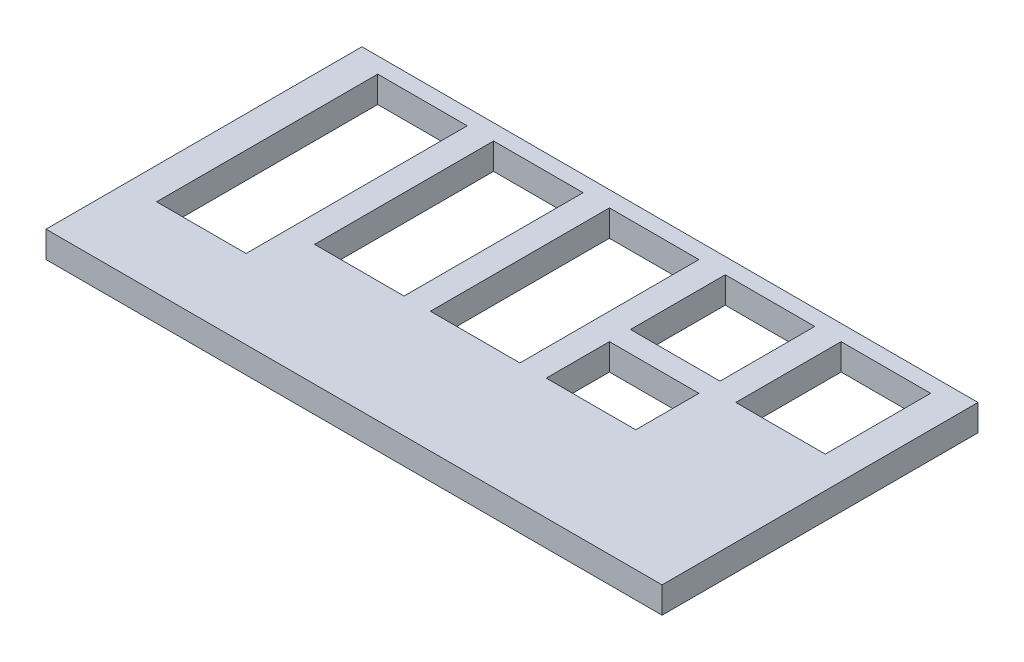
ISO-10303-21;
HEADER;
FILE_DESCRIPTION(('STEP AP214'),'2;1');
FILE_NAME('part.step','',(''),(''),'','','');
FILE_SCHEMA(('AUTOMOTIVE_DESIGN { 1 0 10303 214 1 1 1 1 }'));
ENDSEC;
DATA;
#1=APPLICATION_CONTEXT('core data for automotive mechanical design processes');
#2=APPLICATION_PROTOCOL_DEFINITION('international standard','automotive_design',2000,#1);
#3=PRODUCT_CONTEXT('',#1,'mechanical');
#4=PRODUCT('Part','Part','',(#3));
#5=PRODUCT_RELATED_PRODUCT_CATEGORY('part','',(#4));
#6=PRODUCT_DEFINITION_FORMATION('','',#4);
#7=PRODUCT_DEFINITION_CONTEXT('part definition',#1,'design');
#8=PRODUCT_DEFINITION('design','',#6,#7);
#9=PRODUCT_DEFINITION_SHAPE('','',#8);
#10=(LENGTH_UNIT() NAMED_UNIT(*) SI_UNIT(.MILLI.,.METRE.));
#11=(NAMED_UNIT(*) PLANE_ANGLE_UNIT() SI_UNIT($,.RADIAN.));
#12=(NAMED_UNIT(*) SI_UNIT($,.STERADIAN.) SOLID_ANGLE_UNIT());
#13=UNCERTAINTY_MEASURE_WITH_UNIT(LENGTH_MEASURE(1.E-05),#10,'distance_accuracy_value','');
#14=(GEOMETRIC_REPRESENTATION_CONTEXT(3) GLOBAL_UNCERTAINTY_ASSIGNED_CONTEXT((#13)) GLOBAL_UNIT_ASSIGNED_CONTEXT((#10,
#11,#12)) REPRESENTATION_CONTEXT('',''));
#15=CARTESIAN_POINT('',(0.,0.,0.));
#16=DIRECTION('',(0.,0.,1.));
#17=DIRECTION('',(1.,0.,0.));
#18=AXIS2_PLACEMENT_3D('',#15,#16,#17);
#19=CARTESIAN_POINT('',(0.,5.,-5.));
#20=DIRECTION('',(0.,0.,-1.));
#21=DIRECTION('',(-1.,0.,0.));
#22=AXIS2_PLACEMENT_3D('',#19,#20,#21);
#23=PLANE('',#22);
#24=DIRECTION('',(1.,0.,0.));
#25=VECTOR('',#24,1.);
#26=CARTESIAN_POINT('',(0.,0.,-5.));
#27=LINE('',#26,#25);
#28=CARTESIAN_POINT('',(13.5,0.,-5.));
#29=VERTEX_POINT('',#28);
#30=CARTESIAN_POINT('',(30.5,0.,-5.));
#31=VERTEX_POINT('',#30);
#32=EDGE_CURVE('E322',#29,#31,#27,.T.);
#33=ORIENTED_EDGE('',*,*,#32,.T.);
#34=DIRECTION('',(0.,-1.,0.));
#35=VECTOR('',#34,1.);
#36=CARTESIAN_POINT('',(30.5,5.,-5.));
#37=LINE('',#36,#35);
#38=CARTESIAN_POINT('',(30.5,5.,-5.));
#39=VERTEX_POINT('',#38);
#40=EDGE_CURVE('E11',#39,#31,#37,.T.);
#41=ORIENTED_EDGE('',*,*,#40,.F.);
#42=DIRECTION('',(1.,0.,0.));
#43=VECTOR('',#42,1.);
#44=CARTESIAN_POINT('',(0.,5.,-5.));
#45=LINE('',#44,#43);
#46=CARTESIAN_POINT('',(13.5,5.,-5.));
#47=VERTEX_POINT('',#46);
#48=EDGE_CURVE('E234',#47,#39,#45,.T.);
#49=ORIENTED_EDGE('',*,*,#48,.F.);
#50=DIRECTION('',(0.,-1.,0.));
#51=VECTOR('',#50,1.);
#52=CARTESIAN_POINT('',(13.5,5.,-5.));
#53=LINE('',#52,#51);
#54=EDGE_CURVE('E54',#47,#29,#53,.T.);
#55=ORIENTED_EDGE('',*,*,#54,.T.);
#56=EDGE_LOOP('',(#33,#41,#49,#55));
#57=FACE_BOUND('',#56,.T.);
#58=ADVANCED_FACE('F35',(#57),#23,.F.);
#59=CARTESIAN_POINT('',(30.5,5.,0.));
#60=DIRECTION('',(1.,0.,0.));
#61=DIRECTION('',(0.,0.,-1.));
#62=AXIS2_PLACEMENT_3D('',#59,#60,#61);
#63=PLANE('',#62);
#64=DIRECTION('',(0.,0.,1.));
#65=VECTOR('',#64,1.);
#66=CARTESIAN_POINT('',(30.5,0.,0.));
#67=LINE('',#66,#65);
#68=CARTESIAN_POINT('',(30.5,0.,7.));
#69=VERTEX_POINT('',#68);
#70=EDGE_CURVE('E240',#31,#69,#67,.T.);
#71=ORIENTED_EDGE('',*,*,#70,.T.);
#72=DIRECTION('',(0.,-1.,0.));
#73=VECTOR('',#72,1.);
#74=CARTESIAN_POINT('',(30.5,5.,7.));
#75=LINE('',#74,#73);
#76=CARTESIAN_POINT('',(30.5,5.,7.));
#77=VERTEX_POINT('',#76);
#78=EDGE_CURVE('E45',#77,#69,#75,.T.);
#79=ORIENTED_EDGE('',*,*,#78,.F.);
#80=DIRECTION('',(0.,0.,1.));
#81=VECTOR('',#80,1.);
#82=CARTESIAN_POINT('',(30.5,5.,0.));
#83=LINE('',#82,#81);
#84=EDGE_CURVE('E228',#39,#77,#83,.T.);
#85=ORIENTED_EDGE('',*,*,#84,.F.);
#86=ORIENTED_EDGE('',*,*,#40,.T.);
#87=EDGE_LOOP('',(#71,#79,#85,#86));
#88=FACE_BOUND('',#87,.T.);
#89=ADVANCED_FACE('F239',(#88),#63,.F.);
#90=CARTESIAN_POINT('',(0.,5.,7.));
#91=DIRECTION('',(0.,0.,-1.));
#92=DIRECTION('',(-1.,0.,0.));
#93=AXIS2_PLACEMENT_3D('',#90,#91,#92);
#94=PLANE('',#93);
#95=DIRECTION('',(1.,0.,0.));
#96=VECTOR('',#95,1.);
#97=CARTESIAN_POINT('',(0.,0.,7.));
#98=LINE('',#97,#96);
#99=CARTESIAN_POINT('',(13.5,0.,7.));
#100=VERTEX_POINT('',#99);
#101=EDGE_CURVE('E325',#100,#69,#98,.T.);
#102=ORIENTED_EDGE('',*,*,#101,.F.);
#103=DIRECTION('',(0.,-1.,0.));
#104=VECTOR('',#103,1.);
#105=CARTESIAN_POINT('',(13.5,5.,7.));
#106=LINE('',#105,#104);
#107=CARTESIAN_POINT('',(13.5,5.,7.));
#108=VERTEX_POINT('',#107);
#109=EDGE_CURVE('E140',#108,#100,#106,.T.);
#110=ORIENTED_EDGE('',*,*,#109,.F.);
#111=DIRECTION('',(1.,0.,0.));
#112=VECTOR('',#111,1.);
#113=CARTESIAN_POINT('',(0.,5.,7.));
#114=LINE('',#113,#112);
#115=EDGE_CURVE('E233',#108,#77,#114,.T.);
#116=ORIENTED_EDGE('',*,*,#115,.T.);
#117=ORIENTED_EDGE('',*,*,#78,.T.);
#118=EDGE_LOOP('',(#102,#110,#116,#117));
#119=FACE_BOUND('',#118,.T.);
#120=ADVANCED_FACE('F244',(#119),#94,.T.);
#121=CARTESIAN_POINT('',(0.,5.,30.));
#122=DIRECTION('',(0.,0.,-1.));
#123=DIRECTION('',(-1.,0.,0.));
#124=AXIS2_PLACEMENT_3D('',#121,#122,#123);
#125=PLANE('',#124);
#126=DIRECTION('',(1.,0.,0.));
#127=VECTOR('',#126,1.);
#128=CARTESIAN_POINT('',(0.,0.,30.));
#129=LINE('',#128,#127);
#130=CARTESIAN_POINT('',(-58.5,0.,30.));
#131=VERTEX_POINT('',#130);
#132=CARTESIAN_POINT('',(58.5,0.,30.));
#133=VERTEX_POINT('',#132);
#134=EDGE_CURVE('E310',#131,#133,#129,.T.);
#135=ORIENTED_EDGE('',*,*,#134,.T.);
#136=DIRECTION('',(0.,-1.,0.));
#137=VECTOR('',#136,1.);
#138=CARTESIAN_POINT('',(58.5,5.,30.));
#139=LINE('',#138,#137);
#140=CARTESIAN_POINT('',(58.5,5.,30.));
#141=VERTEX_POINT('',#140);
#142=EDGE_CURVE('E332',#141,#133,#139,.T.);
#143=ORIENTED_EDGE('',*,*,#142,.F.);
#144=DIRECTION('',(1.,0.,0.));
#145=VECTOR('',#144,1.);
#146=CARTESIAN_POINT('',(0.,5.,30.));
#147=LINE('',#146,#145);
#148=CARTESIAN_POINT('',(-58.5,5.,30.));
#149=VERTEX_POINT('',#148);
#150=EDGE_CURVE('E452',#149,#141,#147,.T.);
#151=ORIENTED_EDGE('',*,*,#150,.F.);
#152=DIRECTION('',(0.,-1.,0.));
#153=VECTOR('',#152,1.);
#154=CARTESIAN_POINT('',(-58.5,5.,30.));
#155=LINE('',#154,#153);
#156=EDGE_CURVE('E334',#149,#131,#155,.T.);
#157=ORIENTED_EDGE('',*,*,#156,.T.);
#158=EDGE_LOOP('',(#135,#143,#151,#157));
#159=FACE_BOUND('',#158,.T.);
#160=ADVANCED_FACE('F478',(#159),#125,.F.);
#161=CARTESIAN_POINT('',(58.5,5.,0.));
#162=DIRECTION('',(-1.,0.,0.));
#163=DIRECTION('',(0.,0.,1.));
#164=AXIS2_PLACEMENT_3D('',#161,#162,#163);
#165=PLANE('',#164);
#166=DIRECTION('',(0.,0.,-1.));
#167=VECTOR('',#166,1.);
#168=CARTESIAN_POINT('',(58.5,0.,0.));
#169=LINE('',#168,#167);
#170=CARTESIAN_POINT('',(58.5,0.,-30.));
#171=VERTEX_POINT('',#170);
#172=EDGE_CURVE('E313',#133,#171,#169,.T.);
#173=ORIENTED_EDGE('',*,*,#172,.T.);
#174=DIRECTION('',(0.,-1.,0.));
#175=VECTOR('',#174,1.);
#176=CARTESIAN_POINT('',(58.5,5.,-30.));
#177=LINE('',#176,#175);
#178=CARTESIAN_POINT('',(58.5,5.,-30.));
#179=VERTEX_POINT('',#178);
#180=EDGE_CURVE('E339',#179,#171,#177,.T.);
#181=ORIENTED_EDGE('',*,*,#180,.F.);
#182=DIRECTION('',(0.,0.,-1.));
#183=VECTOR('',#182,1.);
#184=CARTESIAN_POINT('',(58.5,5.,0.));
#185=LINE('',#184,#183);
#186=EDGE_CURVE('E455',#141,#179,#185,.T.);
#187=ORIENTED_EDGE('',*,*,#186,.F.);
#188=ORIENTED_EDGE('',*,*,#142,.T.);
#189=EDGE_LOOP('',(#173,#181,#187,#188));
#190=FACE_BOUND('',#189,.T.);
#191=ADVANCED_FACE('F480',(#190),#165,.F.);
#192=CARTESIAN_POINT('',(0.,5.,-30.));
#193=DIRECTION('',(0.,0.,-1.));
#194=DIRECTION('',(-1.,0.,0.));
#195=AXIS2_PLACEMENT_3D('',#192,#193,#194);
#196=PLANE('',#195);
#197=DIRECTION('',(1.,0.,0.));
#198=VECTOR('',#197,1.);
#199=CARTESIAN_POINT('',(0.,0.,-30.));
#200=LINE('',#199,#198);
#201=CARTESIAN_POINT('',(-58.5,0.,-30.));
#202=VERTEX_POINT('',#201);
#203=EDGE_CURVE('E316',#202,#171,#200,.T.);
#204=ORIENTED_EDGE('',*,*,#203,.F.);
#205=DIRECTION('',(0.,-1.,0.));
#206=VECTOR('',#205,1.);
#207=CARTESIAN_POINT('',(-58.5,5.,-30.));
#208=LINE('',#207,#206);
#209=CARTESIAN_POINT('',(-58.5,5.,-30.));
#210=VERTEX_POINT('',#209);
#211=EDGE_CURVE('E336',#210,#202,#208,.T.);
#212=ORIENTED_EDGE('',*,*,#211,.F.);
#213=DIRECTION('',(1.,0.,0.));
#214=VECTOR('',#213,1.);
#215=CARTESIAN_POINT('',(0.,5.,-30.));
#216=LINE('',#215,#214);
#217=EDGE_CURVE('E457',#210,#179,#216,.T.);
#218=ORIENTED_EDGE('',*,*,#217,.T.);
#219=ORIENTED_EDGE('',*,*,#180,.T.);
#220=EDGE_LOOP('',(#204,#212,#218,#219));
#221=FACE_BOUND('',#220,.T.);
#222=ADVANCED_FACE('F473',(#221),#196,.T.);
#223=CARTESIAN_POINT('',(-35.5,5.,0.));
#224=DIRECTION('',(-1.,0.,0.));
#225=DIRECTION('',(0.,0.,1.));
#226=AXIS2_PLACEMENT_3D('',#223,#224,#225);
#227=PLANE('',#226);
#228=DIRECTION('',(0.,0.,-1.));
#229=VECTOR('',#228,1.);
#230=CARTESIAN_POINT('',(-35.5,0.,0.));
#231=LINE('',#230,#229);
#232=CARTESIAN_POINT('',(-35.5,0.,15.));
#233=VERTEX_POINT('',#232);
#234=CARTESIAN_POINT('',(-35.5,0.,-27.));
#235=VERTEX_POINT('',#234);
#236=EDGE_CURVE('E298',#233,#235,#231,.T.);
#237=ORIENTED_EDGE('',*,*,#236,.F.);
#238=DIRECTION('',(0.,-1.,0.));
#239=VECTOR('',#238,1.);
#240=CARTESIAN_POINT('',(-35.5,5.,15.));
#241=LINE('',#240,#239);
#242=CARTESIAN_POINT('',(-35.5,5.,15.));
#243=VERTEX_POINT('',#242);
#244=EDGE_CURVE('E337',#243,#233,#241,.T.);
#245=ORIENTED_EDGE('',*,*,#244,.F.);
#246=DIRECTION('',(0.,0.,-1.));
#247=VECTOR('',#246,1.);
#248=CARTESIAN_POINT('',(-35.5,5.,0.));
#249=LINE('',#248,#247);
#250=CARTESIAN_POINT('',(-35.5,5.,-27.));
#251=VERTEX_POINT('',#250);
#252=EDGE_CURVE('E441',#243,#251,#249,.T.);
#253=ORIENTED_EDGE('',*,*,#252,.T.);
#254=DIRECTION('',(0.,-1.,0.));
#255=VECTOR('',#254,1.);
#256=CARTESIAN_POINT('',(-35.5,5.,-27.));
#257=LINE('',#256,#255);
#258=EDGE_CURVE('E343',#251,#235,#257,.T.);
#259=ORIENTED_EDGE('',*,*,#258,.T.);
#260=EDGE_LOOP('',(#237,#245,#253,#259));
#261=FACE_BOUND('',#260,.T.);
#262=ADVANCED_FACE('F487',(#261),#227,.T.);
#263=CARTESIAN_POINT('',(0.,5.,15.));
#264=DIRECTION('',(0.,0.,-1.));
#265=DIRECTION('',(-1.,0.,0.));
#266=AXIS2_PLACEMENT_3D('',#263,#264,#265);
#267=PLANE('',#266);
#268=DIRECTION('',(1.,0.,0.));
#269=VECTOR('',#268,1.);
#270=CARTESIAN_POINT('',(0.,0.,15.));
#271=LINE('',#270,#269);
#272=CARTESIAN_POINT('',(-52.5,0.,15.));
#273=VERTEX_POINT('',#272);
#274=EDGE_CURVE('E301',#273,#233,#271,.T.);
#275=ORIENTED_EDGE('',*,*,#274,.F.);
#276=DIRECTION('',(0.,-1.,0.));
#277=VECTOR('',#276,1.);
#278=CARTESIAN_POINT('',(-52.5,5.,15.));
#279=LINE('',#278,#277);
#280=CARTESIAN_POINT('',(-52.5,5.,15.));
#281=VERTEX_POINT('',#280);
#282=EDGE_CURVE('E349',#281,#273,#279,.T.);
#283=ORIENTED_EDGE('',*,*,#282,.F.);
#284=DIRECTION('',(1.,0.,0.));
#285=VECTOR('',#284,1.);
#286=CARTESIAN_POINT('',(0.,5.,15.));
#287=LINE('',#286,#285);
#288=EDGE_CURVE('E444',#281,#243,#287,.T.);
#289=ORIENTED_EDGE('',*,*,#288,.T.);
#290=ORIENTED_EDGE('',*,*,#244,.T.);
#291=EDGE_LOOP('',(#275,#283,#289,#290));
#292=FACE_BOUND('',#291,.T.);
#293=ADVANCED_FACE('F565',(#292),#267,.T.);
#294=CARTESIAN_POINT('',(-52.5,5.,0.));
#295=DIRECTION('',(-1.,0.,0.));
#296=DIRECTION('',(0.,0.,1.));
#297=AXIS2_PLACEMENT_3D('',#294,#295,#296);
#298=PLANE('',#297);
#299=DIRECTION('',(0.,0.,-1.));
#300=VECTOR('',#299,1.);
#301=CARTESIAN_POINT('',(-52.5,0.,0.));
#302=LINE('',#301,#300);
#303=CARTESIAN_POINT('',(-52.5,0.,-27.));
#304=VERTEX_POINT('',#303);
#305=EDGE_CURVE('E304',#273,#304,#302,.T.);
#306=ORIENTED_EDGE('',*,*,#305,.T.);
#307=DIRECTION('',(0.,-1.,0.));
#308=VECTOR('',#307,1.);
#309=CARTESIAN_POINT('',(-52.5,5.,-27.));
#310=LINE('',#309,#308);
#311=CARTESIAN_POINT('',(-52.5,5.,-27.));
#312=VERTEX_POINT('',#311);
#313=EDGE_CURVE('E345',#312,#304,#310,.T.);
#314=ORIENTED_EDGE('',*,*,#313,.F.);
#315=DIRECTION('',(0.,0.,-1.));
#316=VECTOR('',#315,1.);
#317=CARTESIAN_POINT('',(-52.5,5.,0.));
#318=LINE('',#317,#316);
#319=EDGE_CURVE('E447',#281,#312,#318,.T.);
#320=ORIENTED_EDGE('',*,*,#319,.F.);
#321=ORIENTED_EDGE('',*,*,#282,.T.);
#322=EDGE_LOOP('',(#306,#314,#320,#321));
#323=FACE_BOUND('',#322,.T.);
#324=ADVANCED_FACE('F552',(#323),#298,.F.);
#325=CARTESIAN_POINT('',(-30.5,5.,0.));
#326=DIRECTION('',(1.,0.,0.));
#327=DIRECTION('',(0.,0.,-1.));
#328=AXIS2_PLACEMENT_3D('',#325,#326,#327);
#329=PLANE('',#328);
#330=DIRECTION('',(0.,0.,1.));
#331=VECTOR('',#330,1.);
#332=CARTESIAN_POINT('',(-30.5,0.,0.));
#333=LINE('',#332,#331);
#334=CARTESIAN_POINT('',(-30.5,0.,-27.));
#335=VERTEX_POINT('',#334);
#336=CARTESIAN_POINT('',(-30.5,0.,6.99999999999999));
#337=VERTEX_POINT('',#336);
#338=EDGE_CURVE('E286',#335,#337,#333,.T.);
#339=ORIENTED_EDGE('',*,*,#338,.F.);
#340=DIRECTION('',(0.,-1.,0.));
#341=VECTOR('',#340,1.);
#342=CARTESIAN_POINT('',(-30.5,5.,-27.));
#343=LINE('',#342,#341);
#344=CARTESIAN_POINT('',(-30.5,5.,-27.));
#345=VERTEX_POINT('',#344);
#346=EDGE_CURVE('E346',#345,#335,#343,.T.);
#347=ORIENTED_EDGE('',*,*,#346,.F.);
#348=DIRECTION('',(0.,0.,1.));
#349=VECTOR('',#348,1.);
#350=CARTESIAN_POINT('',(-30.5,5.,0.));
#351=LINE('',#350,#349);
#352=CARTESIAN_POINT('',(-30.5,5.,6.99999999999999));
#353=VERTEX_POINT('',#352);
#354=EDGE_CURVE('E430',#345,#353,#351,.T.);
#355=ORIENTED_EDGE('',*,*,#354,.T.);
#356=DIRECTION('',(0.,-1.,0.));
#357=VECTOR('',#356,1.);
#358=CARTESIAN_POINT('',(-30.5,5.,6.99999999999999));
#359=LINE('',#358,#357);
#360=EDGE_CURVE('E352',#353,#337,#359,.T.);
#361=ORIENTED_EDGE('',*,*,#360,.T.);
#362=EDGE_LOOP('',(#339,#347,#355,#361));
#363=FACE_BOUND('',#362,.T.);
#364=ADVANCED_FACE('F548',(#363),#329,.T.);
#365=CARTESIAN_POINT('',(0.,5.,-27.));
#366=DIRECTION('',(0.,0.,1.));
#367=DIRECTION('',(1.,0.,0.));
#368=AXIS2_PLACEMENT_3D('',#365,#366,#367);
#369=PLANE('',#368);
#370=DIRECTION('',(-1.,0.,0.));
#371=VECTOR('',#370,1.);
#372=CARTESIAN_POINT('',(0.,0.,-27.));
#373=LINE('',#372,#371);
#374=CARTESIAN_POINT('',(-13.5,0.,-27.));
#375=VERTEX_POINT('',#374);
#376=EDGE_CURVE('E289',#375,#335,#373,.T.);
#377=ORIENTED_EDGE('',*,*,#376,.F.);
#378=DIRECTION('',(0.,-1.,0.));
#379=VECTOR('',#378,1.);
#380=CARTESIAN_POINT('',(-13.5,5.,-27.));
#381=LINE('',#380,#379);
#382=CARTESIAN_POINT('',(-13.5,5.,-27.));
#383=VERTEX_POINT('',#382);
#384=EDGE_CURVE('E358',#383,#375,#381,.T.);
#385=ORIENTED_EDGE('',*,*,#384,.F.);
#386=DIRECTION('',(-1.,0.,0.));
#387=VECTOR('',#386,1.);
#388=CARTESIAN_POINT('',(0.,5.,-27.));
#389=LINE('',#388,#387);
#390=EDGE_CURVE('E433',#383,#345,#389,.T.);
#391=ORIENTED_EDGE('',*,*,#390,.T.);
#392=ORIENTED_EDGE('',*,*,#346,.T.);
#393=EDGE_LOOP('',(#377,#385,#391,#392));
#394=FACE_BOUND('',#393,.T.);
#395=ADVANCED_FACE('F551',(#394),#369,.T.);
#396=CARTESIAN_POINT('',(-13.5,5.,0.));
#397=DIRECTION('',(1.,0.,0.));
#398=DIRECTION('',(0.,0.,-1.));
#399=AXIS2_PLACEMENT_3D('',#396,#397,#398);
#400=PLANE('',#399);
#401=DIRECTION('',(0.,0.,1.));
#402=VECTOR('',#401,1.);
#403=CARTESIAN_POINT('',(-13.5,0.,0.));
#404=LINE('',#403,#402);
#405=CARTESIAN_POINT('',(-13.5,0.,6.99999999999999));
#406=VERTEX_POINT('',#405);
#407=EDGE_CURVE('E292',#375,#406,#404,.T.);
#408=ORIENTED_EDGE('',*,*,#407,.T.);
#409=DIRECTION('',(0.,-1.,0.));
#410=VECTOR('',#409,1.);
#411=CARTESIAN_POINT('',(-13.5,5.,6.99999999999999));
#412=LINE('',#411,#410);
#413=CARTESIAN_POINT('',(-13.5,5.,6.99999999999999));
#414=VERTEX_POINT('',#413);
#415=EDGE_CURVE('E354',#414,#406,#412,.T.);
#416=ORIENTED_EDGE('',*,*,#415,.F.);
#417=DIRECTION('',(0.,0.,1.));
#418=VECTOR('',#417,1.);
#419=CARTESIAN_POINT('',(-13.5,5.,0.));
#420=LINE('',#419,#418);
#421=EDGE_CURVE('E436',#383,#414,#420,.T.);
#422=ORIENTED_EDGE('',*,*,#421,.F.);
#423=ORIENTED_EDGE('',*,*,#384,.T.);
#424=EDGE_LOOP('',(#408,#416,#422,#423));
#425=FACE_BOUND('',#424,.T.);
#426=ADVANCED_FACE('F537',(#425),#400,.F.);
#427=CARTESIAN_POINT('',(30.5,5.,0.));
#428=DIRECTION('',(-1.,0.,0.));
#429=DIRECTION('',(0.,0.,1.));
#430=AXIS2_PLACEMENT_3D('',#427,#428,#429);
#431=PLANE('',#430);
#432=DIRECTION('',(0.,0.,-1.));
#433=VECTOR('',#432,1.);
#434=CARTESIAN_POINT('',(30.5,0.,0.));
#435=LINE('',#434,#433);
#436=CARTESIAN_POINT('',(30.5,0.,-9.));
#437=VERTEX_POINT('',#436);
#438=CARTESIAN_POINT('',(30.5,0.,-27.));
#439=VERTEX_POINT('',#438);
#440=EDGE_CURVE('E274',#437,#439,#435,.T.);
#441=ORIENTED_EDGE('',*,*,#440,.F.);
#442=DIRECTION('',(0.,-1.,0.));
#443=VECTOR('',#442,1.);
#444=CARTESIAN_POINT('',(30.5,5.,-9.));
#445=LINE('',#444,#443);
#446=CARTESIAN_POINT('',(30.5,5.,-9.));
#447=VERTEX_POINT('',#446);
#448=EDGE_CURVE('E355',#447,#437,#445,.T.);
#449=ORIENTED_EDGE('',*,*,#448,.F.);
#450=DIRECTION('',(0.,0.,-1.));
#451=VECTOR('',#450,1.);
#452=CARTESIAN_POINT('',(30.5,5.,0.));
#453=LINE('',#452,#451);
#454=CARTESIAN_POINT('',(30.5,5.,-27.));
#455=VERTEX_POINT('',#454);
#456=EDGE_CURVE('E419',#447,#455,#453,.T.);
#457=ORIENTED_EDGE('',*,*,#456,.T.);
#458=DIRECTION('',(0.,-1.,0.));
#459=VECTOR('',#458,1.);
#460=CARTESIAN_POINT('',(30.5,5.,-27.));
#461=LINE('',#460,#459);
#462=EDGE_CURVE('E361',#455,#439,#461,.T.);
#463=ORIENTED_EDGE('',*,*,#462,.T.);
#464=EDGE_LOOP('',(#441,#449,#457,#463));
#465=FACE_BOUND('',#464,.T.);
#466=ADVANCED_FACE('F533',(#465),#431,.T.);
#467=CARTESIAN_POINT('',(0.,5.,-9.));
#468=DIRECTION('',(0.,0.,-1.));
#469=DIRECTION('',(-1.,0.,0.));
#470=AXIS2_PLACEMENT_3D('',#467,#468,#469);
#471=PLANE('',#470);
#472=DIRECTION('',(1.,0.,0.));
#473=VECTOR('',#472,1.);
#474=CARTESIAN_POINT('',(0.,0.,-9.));
#475=LINE('',#474,#473);
#476=CARTESIAN_POINT('',(13.5,0.,-9.));
#477=VERTEX_POINT('',#476);
#478=EDGE_CURVE('E277',#477,#437,#475,.T.);
#479=ORIENTED_EDGE('',*,*,#478,.F.);
#480=DIRECTION('',(0.,-1.,0.));
#481=VECTOR('',#480,1.);
#482=CARTESIAN_POINT('',(13.5,5.,-9.));
#483=LINE('',#482,#481);
#484=CARTESIAN_POINT('',(13.5,5.,-9.));
#485=VERTEX_POINT('',#484);
#486=EDGE_CURVE('E367',#485,#477,#483,.T.);
#487=ORIENTED_EDGE('',*,*,#486,.F.);
#488=DIRECTION('',(1.,0.,0.));
#489=VECTOR('',#488,1.);
#490=CARTESIAN_POINT('',(0.,5.,-9.));
#491=LINE('',#490,#489);
#492=EDGE_CURVE('E422',#485,#447,#491,.T.);
#493=ORIENTED_EDGE('',*,*,#492,.T.);
#494=ORIENTED_EDGE('',*,*,#448,.T.);
#495=EDGE_LOOP('',(#479,#487,#493,#494));
#496=FACE_BOUND('',#495,.T.);
#497=ADVANCED_FACE('F536',(#496),#471,.T.);
#498=CARTESIAN_POINT('',(13.5,5.,0.));
#499=DIRECTION('',(-1.,0.,0.));
#500=DIRECTION('',(0.,0.,1.));
#501=AXIS2_PLACEMENT_3D('',#498,#499,#500);
#502=PLANE('',#501);
#503=DIRECTION('',(0.,0.,-1.));
#504=VECTOR('',#503,1.);
#505=CARTESIAN_POINT('',(13.5,0.,0.));
#506=LINE('',#505,#504);
#507=CARTESIAN_POINT('',(13.5,0.,-27.));
#508=VERTEX_POINT('',#507);
#509=EDGE_CURVE('E280',#477,#508,#506,.T.);
#510=ORIENTED_EDGE('',*,*,#509,.T.);
#511=DIRECTION('',(0.,-1.,0.));
#512=VECTOR('',#511,1.);
#513=CARTESIAN_POINT('',(13.5,5.,-27.));
#514=LINE('',#513,#512);
#515=CARTESIAN_POINT('',(13.5,5.,-27.));
#516=VERTEX_POINT('',#515);
#517=EDGE_CURVE('E363',#516,#508,#514,.T.);
#518=ORIENTED_EDGE('',*,*,#517,.F.);
#519=DIRECTION('',(0.,0.,-1.));
#520=VECTOR('',#519,1.);
#521=CARTESIAN_POINT('',(13.5,5.,0.));
#522=LINE('',#521,#520);
#523=EDGE_CURVE('E425',#485,#516,#522,.T.);
#524=ORIENTED_EDGE('',*,*,#523,.F.);
#525=ORIENTED_EDGE('',*,*,#486,.T.);
#526=EDGE_LOOP('',(#510,#518,#524,#525));
#527=FACE_BOUND('',#526,.T.);
#528=ADVANCED_FACE('F520',(#527),#502,.F.);
#529=CARTESIAN_POINT('',(8.5,5.,0.));
#530=DIRECTION('',(-1.,0.,0.));
#531=DIRECTION('',(0.,0.,1.));
#532=AXIS2_PLACEMENT_3D('',#529,#530,#531);
#533=PLANE('',#532);
#534=DIRECTION('',(0.,0.,-1.));
#535=VECTOR('',#534,1.);
#536=CARTESIAN_POINT('',(8.5,0.,0.));
#537=LINE('',#536,#535);
#538=CARTESIAN_POINT('',(8.5,0.,7.));
#539=VERTEX_POINT('',#538);
#540=CARTESIAN_POINT('',(8.5,0.,-27.));
#541=VERTEX_POINT('',#540);
#542=EDGE_CURVE('E262',#539,#541,#537,.T.);
#543=ORIENTED_EDGE('',*,*,#542,.F.);
#544=DIRECTION('',(0.,-1.,0.));
#545=VECTOR('',#544,1.);
#546=CARTESIAN_POINT('',(8.5,5.,7.));
#547=LINE('',#546,#545);
#548=CARTESIAN_POINT('',(8.5,5.,7.));
#549=VERTEX_POINT('',#548);
#550=EDGE_CURVE('E364',#549,#539,#547,.T.);
#551=ORIENTED_EDGE('',*,*,#550,.F.);
#552=DIRECTION('',(0.,0.,-1.));
#553=VECTOR('',#552,1.);
#554=CARTESIAN_POINT('',(8.5,5.,0.));
#555=LINE('',#554,#553);
#556=CARTESIAN_POINT('',(8.5,5.,-27.));
#557=VERTEX_POINT('',#556);
#558=EDGE_CURVE('E403',#549,#557,#555,.T.);
#559=ORIENTED_EDGE('',*,*,#558,.T.);
#560=DIRECTION('',(0.,-1.,0.));
#561=VECTOR('',#560,1.);
#562=CARTESIAN_POINT('',(8.5,5.,-27.));
#563=LINE('',#562,#561);
#564=EDGE_CURVE('E370',#557,#541,#563,.T.);
#565=ORIENTED_EDGE('',*,*,#564,.T.);
#566=EDGE_LOOP('',(#543,#551,#559,#565));
#567=FACE_BOUND('',#566,.T.);
#568=ADVANCED_FACE('F516',(#567),#533,.T.);
#569=CARTESIAN_POINT('',(0.,5.,7.));
#570=DIRECTION('',(0.,0.,-1.));
#571=DIRECTION('',(-1.,0.,0.));
#572=AXIS2_PLACEMENT_3D('',#569,#570,#571);
#573=PLANE('',#572);
#574=DIRECTION('',(1.,0.,0.));
#575=VECTOR('',#574,1.);
#576=CARTESIAN_POINT('',(0.,0.,7.));
#577=LINE('',#576,#575);
#578=CARTESIAN_POINT('',(-8.5,0.,7.));
#579=VERTEX_POINT('',#578);
#580=EDGE_CURVE('E265',#579,#539,#577,.T.);
#581=ORIENTED_EDGE('',*,*,#580,.F.);
#582=DIRECTION('',(0.,-1.,0.));
#583=VECTOR('',#582,1.);
#584=CARTESIAN_POINT('',(-8.5,5.,7.));
#585=LINE('',#584,#583);
#586=CARTESIAN_POINT('',(-8.5,5.,7.));
#587=VERTEX_POINT('',#586);
#588=EDGE_CURVE('E375',#587,#579,#585,.T.);
#589=ORIENTED_EDGE('',*,*,#588,.F.);
#590=DIRECTION('',(1.,0.,0.));
#591=VECTOR('',#590,1.);
#592=CARTESIAN_POINT('',(0.,5.,7.));
#593=LINE('',#592,#591);
#594=EDGE_CURVE('E407',#587,#549,#593,.T.);
#595=ORIENTED_EDGE('',*,*,#594,.T.);
#596=ORIENTED_EDGE('',*,*,#550,.T.);
#597=EDGE_LOOP('',(#581,#589,#595,#596));
#598=FACE_BOUND('',#597,.T.);
#599=ADVANCED_FACE('F519',(#598),#573,.T.);
#600=CARTESIAN_POINT('',(-8.5,5.,0.));
#601=DIRECTION('',(-1.,0.,0.));
#602=DIRECTION('',(0.,0.,1.));
#603=AXIS2_PLACEMENT_3D('',#600,#601,#602);
#604=PLANE('',#603);
#605=DIRECTION('',(0.,0.,-1.));
#606=VECTOR('',#605,1.);
#607=CARTESIAN_POINT('',(-8.5,0.,0.));
#608=LINE('',#607,#606);
#609=CARTESIAN_POINT('',(-8.5,0.,-27.));
#610=VERTEX_POINT('',#609);
#611=EDGE_CURVE('E268',#579,#610,#608,.T.);
#612=ORIENTED_EDGE('',*,*,#611,.T.);
#613=DIRECTION('',(0.,-1.,0.));
#614=VECTOR('',#613,1.);
#615=CARTESIAN_POINT('',(-8.5,5.,-27.));
#616=LINE('',#615,#614);
#617=CARTESIAN_POINT('',(-8.5,5.,-27.));
#618=VERTEX_POINT('',#617);
#619=EDGE_CURVE('E372',#618,#610,#616,.T.);
#620=ORIENTED_EDGE('',*,*,#619,.F.);
#621=DIRECTION('',(0.,0.,-1.));
#622=VECTOR('',#621,1.);
#623=CARTESIAN_POINT('',(-8.5,5.,0.));
#624=LINE('',#623,#622);
#625=EDGE_CURVE('E414',#587,#618,#624,.T.);
#626=ORIENTED_EDGE('',*,*,#625,.F.);
#627=ORIENTED_EDGE('',*,*,#588,.T.);
#628=EDGE_LOOP('',(#612,#620,#626,#627));
#629=FACE_BOUND('',#628,.T.);
#630=ADVANCED_FACE('F524',(#629),#604,.F.);
#631=CARTESIAN_POINT('',(52.5,5.,0.));
#632=DIRECTION('',(-1.,0.,0.));
#633=DIRECTION('',(0.,0.,1.));
#634=AXIS2_PLACEMENT_3D('',#631,#632,#633);
#635=PLANE('',#634);
#636=DIRECTION('',(0.,0.,-1.));
#637=VECTOR('',#636,1.);
#638=CARTESIAN_POINT('',(52.5,0.,0.));
#639=LINE('',#638,#637);
#640=CARTESIAN_POINT('',(52.5,0.,-6.99999999999999));
#641=VERTEX_POINT('',#640);
#642=CARTESIAN_POINT('',(52.5,0.,-27.));
#643=VERTEX_POINT('',#642);
#644=EDGE_CURVE('E251',#641,#643,#639,.T.);
#645=ORIENTED_EDGE('',*,*,#644,.F.);
#646=DIRECTION('',(0.,-1.,0.));
#647=VECTOR('',#646,1.);
#648=CARTESIAN_POINT('',(52.5,5.,-6.99999999999999));
#649=LINE('',#648,#647);
#650=CARTESIAN_POINT('',(52.5,5.,-6.99999999999999));
#651=VERTEX_POINT('',#650);
#652=EDGE_CURVE('E39',#651,#641,#649,.T.);
#653=ORIENTED_EDGE('',*,*,#652,.F.);
#654=DIRECTION('',(0.,0.,-1.));
#655=VECTOR('',#654,1.);
#656=CARTESIAN_POINT('',(52.5,5.,0.));
#657=LINE('',#656,#655);
#658=CARTESIAN_POINT('',(52.5,5.,-27.));
#659=VERTEX_POINT('',#658);
#660=EDGE_CURVE('E330',#651,#659,#657,.T.);
#661=ORIENTED_EDGE('',*,*,#660,.T.);
#662=DIRECTION('',(0.,-1.,0.));
#663=VECTOR('',#662,1.);
#664=CARTESIAN_POINT('',(52.5,5.,-27.));
#665=LINE('',#664,#663);
#666=EDGE_CURVE('E247',#659,#643,#665,.T.);
#667=ORIENTED_EDGE('',*,*,#666,.T.);
#668=EDGE_LOOP('',(#645,#653,#661,#667));
#669=FACE_BOUND('',#668,.T.);
#670=ADVANCED_FACE('F37',(#669),#635,.T.);
#671=CARTESIAN_POINT('',(0.,5.,-6.99999999999999));
#672=DIRECTION('',(0.,0.,-1.));
#673=DIRECTION('',(-1.,0.,0.));
#674=AXIS2_PLACEMENT_3D('',#671,#672,#673);
#675=PLANE('',#674);
#676=DIRECTION('',(1.,0.,0.));
#677=VECTOR('',#676,1.);
#678=CARTESIAN_POINT('',(0.,0.,-6.99999999999999));
#679=LINE('',#678,#677);
#680=CARTESIAN_POINT('',(35.5,0.,-6.99999999999999));
#681=VERTEX_POINT('',#680);
#682=EDGE_CURVE('E254',#681,#641,#679,.T.);
#683=ORIENTED_EDGE('',*,*,#682,.F.);
#684=DIRECTION('',(0.,-1.,0.));
#685=VECTOR('',#684,1.);
#686=CARTESIAN_POINT('',(35.5,5.,-6.99999999999999));
#687=LINE('',#686,#685);
#688=CARTESIAN_POINT('',(35.5,5.,-6.99999999999999));
#689=VERTEX_POINT('',#688);
#690=EDGE_CURVE('E381',#689,#681,#687,.T.);
#691=ORIENTED_EDGE('',*,*,#690,.F.);
#692=DIRECTION('',(1.,0.,0.));
#693=VECTOR('',#692,1.);
#694=CARTESIAN_POINT('',(0.,5.,-6.99999999999999));
#695=LINE('',#694,#693);
#696=EDGE_CURVE('E390',#689,#651,#695,.T.);
#697=ORIENTED_EDGE('',*,*,#696,.T.);
#698=ORIENTED_EDGE('',*,*,#652,.T.);
#699=EDGE_LOOP('',(#683,#691,#697,#698));
#700=FACE_BOUND('',#699,.T.);
#701=ADVANCED_FACE('F388',(#700),#675,.T.);
#702=CARTESIAN_POINT('',(35.5,5.,0.));
#703=DIRECTION('',(-1.,0.,0.));
#704=DIRECTION('',(0.,0.,1.));
#705=AXIS2_PLACEMENT_3D('',#702,#703,#704);
#706=PLANE('',#705);
#707=DIRECTION('',(0.,0.,-1.));
#708=VECTOR('',#707,1.);
#709=CARTESIAN_POINT('',(35.5,0.,0.));
#710=LINE('',#709,#708);
#711=CARTESIAN_POINT('',(35.5,0.,-27.));
#712=VERTEX_POINT('',#711);
#713=EDGE_CURVE('E257',#681,#712,#710,.T.);
#714=ORIENTED_EDGE('',*,*,#713,.T.);
#715=DIRECTION('',(0.,-1.,0.));
#716=VECTOR('',#715,1.);
#717=CARTESIAN_POINT('',(35.5,5.,-27.));
#718=LINE('',#717,#716);
#719=CARTESIAN_POINT('',(35.5,5.,-27.));
#720=VERTEX_POINT('',#719);
#721=EDGE_CURVE('E379',#720,#712,#718,.T.);
#722=ORIENTED_EDGE('',*,*,#721,.F.);
#723=DIRECTION('',(0.,0.,-1.));
#724=VECTOR('',#723,1.);
#725=CARTESIAN_POINT('',(35.5,5.,0.));
#726=LINE('',#725,#724);
#727=EDGE_CURVE('E404',#689,#720,#726,.T.);
#728=ORIENTED_EDGE('',*,*,#727,.F.);
#729=ORIENTED_EDGE('',*,*,#690,.T.);
#730=EDGE_LOOP('',(#714,#722,#728,#729));
#731=FACE_BOUND('',#730,.T.);
#732=ADVANCED_FACE('F397',(#731),#706,.F.);
#733=CARTESIAN_POINT('',(-58.5,5.,0.));
#734=DIRECTION('',(-1.,0.,0.));
#735=DIRECTION('',(0.,0.,1.));
#736=AXIS2_PLACEMENT_3D('',#733,#734,#735);
#737=PLANE('',#736);
#738=DIRECTION('',(0.,0.,-1.));
#739=VECTOR('',#738,1.);
#740=CARTESIAN_POINT('',(-58.5,0.,0.));
#741=LINE('',#740,#739);
#742=EDGE_CURVE('E319',#131,#202,#741,.T.);
#743=ORIENTED_EDGE('',*,*,#742,.F.);
#744=ORIENTED_EDGE('',*,*,#156,.F.);
#745=DIRECTION('',(0.,0.,-1.));
#746=VECTOR('',#745,1.);
#747=CARTESIAN_POINT('',(-58.5,5.,0.));
#748=LINE('',#747,#746);
#749=EDGE_CURVE('E460',#149,#210,#748,.T.);
#750=ORIENTED_EDGE('',*,*,#749,.T.);
#751=ORIENTED_EDGE('',*,*,#211,.T.);
#752=EDGE_LOOP('',(#743,#744,#750,#751));
#753=FACE_BOUND('',#752,.T.);
#754=ADVANCED_FACE('F465',(#753),#737,.T.);
#755=CARTESIAN_POINT('',(0.,5.,-27.));
#756=DIRECTION('',(0.,0.,-1.));
#757=DIRECTION('',(-1.,0.,0.));
#758=AXIS2_PLACEMENT_3D('',#755,#756,#757);
#759=PLANE('',#758);
#760=DIRECTION('',(1.,0.,0.));
#761=VECTOR('',#760,1.);
#762=CARTESIAN_POINT('',(0.,0.,-27.));
#763=LINE('',#762,#761);
#764=EDGE_CURVE('E307',#304,#235,#763,.T.);
#765=ORIENTED_EDGE('',*,*,#764,.T.);
#766=ORIENTED_EDGE('',*,*,#258,.F.);
#767=DIRECTION('',(1.,0.,0.));
#768=VECTOR('',#767,1.);
#769=CARTESIAN_POINT('',(0.,5.,-27.));
#770=LINE('',#769,#768);
#771=EDGE_CURVE('E450',#312,#251,#770,.T.);
#772=ORIENTED_EDGE('',*,*,#771,.F.);
#773=ORIENTED_EDGE('',*,*,#313,.T.);
#774=EDGE_LOOP('',(#765,#766,#772,#773));
#775=FACE_BOUND('',#774,.T.);
#776=ADVANCED_FACE('F499',(#775),#759,.F.);
#777=CARTESIAN_POINT('',(0.,5.,6.99999999999999));
#778=DIRECTION('',(0.,0.,1.));
#779=DIRECTION('',(1.,0.,0.));
#780=AXIS2_PLACEMENT_3D('',#777,#778,#779);
#781=PLANE('',#780);
#782=DIRECTION('',(-1.,0.,0.));
#783=VECTOR('',#782,1.);
#784=CARTESIAN_POINT('',(0.,0.,6.99999999999999));
#785=LINE('',#784,#783);
#786=EDGE_CURVE('E295',#406,#337,#785,.T.);
#787=ORIENTED_EDGE('',*,*,#786,.T.);
#788=ORIENTED_EDGE('',*,*,#360,.F.);
#789=DIRECTION('',(-1.,0.,0.));
#790=VECTOR('',#789,1.);
#791=CARTESIAN_POINT('',(0.,5.,6.99999999999999));
#792=LINE('',#791,#790);
#793=EDGE_CURVE('E439',#414,#353,#792,.T.);
#794=ORIENTED_EDGE('',*,*,#793,.F.);
#795=ORIENTED_EDGE('',*,*,#415,.T.);
#796=EDGE_LOOP('',(#787,#788,#794,#795));
#797=FACE_BOUND('',#796,.T.);
#798=ADVANCED_FACE('F504',(#797),#781,.F.);
#799=CARTESIAN_POINT('',(0.,5.,-27.));
#800=DIRECTION('',(0.,0.,-1.));
#801=DIRECTION('',(-1.,0.,0.));
#802=AXIS2_PLACEMENT_3D('',#799,#800,#801);
#803=PLANE('',#802);
#804=DIRECTION('',(1.,0.,0.));
#805=VECTOR('',#804,1.);
#806=CARTESIAN_POINT('',(0.,0.,-27.));
#807=LINE('',#806,#805);
#808=EDGE_CURVE('E283',#508,#439,#807,.T.);
#809=ORIENTED_EDGE('',*,*,#808,.T.);
#810=ORIENTED_EDGE('',*,*,#462,.F.);
#811=DIRECTION('',(1.,0.,0.));
#812=VECTOR('',#811,1.);
#813=CARTESIAN_POINT('',(0.,5.,-27.));
#814=LINE('',#813,#812);
#815=EDGE_CURVE('E428',#516,#455,#814,.T.);
#816=ORIENTED_EDGE('',*,*,#815,.F.);
#817=ORIENTED_EDGE('',*,*,#517,.T.);
#818=EDGE_LOOP('',(#809,#810,#816,#817));
#819=FACE_BOUND('',#818,.T.);
#820=ADVANCED_FACE('F531',(#819),#803,.F.);
#821=CARTESIAN_POINT('',(0.,5.,-27.));
#822=DIRECTION('',(0.,0.,-1.));
#823=DIRECTION('',(-1.,0.,0.));
#824=AXIS2_PLACEMENT_3D('',#821,#822,#823);
#825=PLANE('',#824);
#826=DIRECTION('',(1.,0.,0.));
#827=VECTOR('',#826,1.);
#828=CARTESIAN_POINT('',(0.,0.,-27.));
#829=LINE('',#828,#827);
#830=EDGE_CURVE('E271',#610,#541,#829,.T.);
#831=ORIENTED_EDGE('',*,*,#830,.T.);
#832=ORIENTED_EDGE('',*,*,#564,.F.);
#833=DIRECTION('',(1.,0.,0.));
#834=VECTOR('',#833,1.);
#835=CARTESIAN_POINT('',(0.,5.,-27.));
#836=LINE('',#835,#834);
#837=EDGE_CURVE('E417',#618,#557,#836,.T.);
#838=ORIENTED_EDGE('',*,*,#837,.F.);
#839=ORIENTED_EDGE('',*,*,#619,.T.);
#840=EDGE_LOOP('',(#831,#832,#838,#839));
#841=FACE_BOUND('',#840,.T.);
#842=ADVANCED_FACE('F515',(#841),#825,.F.);
#843=CARTESIAN_POINT('',(0.,5.,-27.));
#844=DIRECTION('',(0.,0.,-1.));
#845=DIRECTION('',(-1.,0.,0.));
#846=AXIS2_PLACEMENT_3D('',#843,#844,#845);
#847=PLANE('',#846);
#848=DIRECTION('',(1.,0.,0.));
#849=VECTOR('',#848,1.);
#850=CARTESIAN_POINT('',(0.,0.,-27.));
#851=LINE('',#850,#849);
#852=EDGE_CURVE('E259',#712,#643,#851,.T.);
#853=ORIENTED_EDGE('',*,*,#852,.T.);
#854=ORIENTED_EDGE('',*,*,#666,.F.);
#855=DIRECTION('',(1.,0.,0.));
#856=VECTOR('',#855,1.);
#857=CARTESIAN_POINT('',(0.,5.,-27.));
#858=LINE('',#857,#856);
#859=EDGE_CURVE('E401',#720,#659,#858,.T.);
#860=ORIENTED_EDGE('',*,*,#859,.F.);
#861=ORIENTED_EDGE('',*,*,#721,.T.);
#862=EDGE_LOOP('',(#853,#854,#860,#861));
#863=FACE_BOUND('',#862,.T.);
#864=ADVANCED_FACE('F400',(#863),#847,.F.);
#865=CARTESIAN_POINT('',(13.5,5.,0.));
#866=DIRECTION('',(1.,0.,0.));
#867=DIRECTION('',(0.,0.,-1.));
#868=AXIS2_PLACEMENT_3D('',#865,#866,#867);
#869=PLANE('',#868);
#870=DIRECTION('',(0.,0.,1.));
#871=VECTOR('',#870,1.);
#872=CARTESIAN_POINT('',(13.5,0.,0.));
#873=LINE('',#872,#871);
#874=EDGE_CURVE('E327',#29,#100,#873,.T.);
#875=ORIENTED_EDGE('',*,*,#874,.F.);
#876=ORIENTED_EDGE('',*,*,#54,.F.);
#877=DIRECTION('',(0.,0.,1.));
#878=VECTOR('',#877,1.);
#879=CARTESIAN_POINT('',(13.5,5.,0.));
#880=LINE('',#879,#878);
#881=EDGE_CURVE('E245',#47,#108,#880,.T.);
#882=ORIENTED_EDGE('',*,*,#881,.T.);
#883=ORIENTED_EDGE('',*,*,#109,.T.);
#884=EDGE_LOOP('',(#875,#876,#882,#883));
#885=FACE_BOUND('',#884,.T.);
#886=ADVANCED_FACE('F514',(#885),#869,.T.);
#887=CARTESIAN_POINT('',(0.,5.,0.));
#888=DIRECTION('',(0.,1.,0.));
#889=DIRECTION('',(0.,0.,1.));
#890=AXIS2_PLACEMENT_3D('',#887,#888,#889);
#891=PLANE('',#890);
#892=ORIENTED_EDGE('',*,*,#660,.F.);
#893=ORIENTED_EDGE('',*,*,#696,.F.);
#894=ORIENTED_EDGE('',*,*,#727,.T.);
#895=ORIENTED_EDGE('',*,*,#859,.T.);
#896=EDGE_LOOP('',(#892,#893,#894,#895));
#897=FACE_BOUND('',#896,.T.);
#898=ORIENTED_EDGE('',*,*,#558,.F.);
#899=ORIENTED_EDGE('',*,*,#594,.F.);
#900=ORIENTED_EDGE('',*,*,#625,.T.);
#901=ORIENTED_EDGE('',*,*,#837,.T.);
#902=EDGE_LOOP('',(#898,#899,#900,#901));
#903=FACE_BOUND('',#902,.T.);
#904=ORIENTED_EDGE('',*,*,#456,.F.);
#905=ORIENTED_EDGE('',*,*,#492,.F.);
#906=ORIENTED_EDGE('',*,*,#523,.T.);
#907=ORIENTED_EDGE('',*,*,#815,.T.);
#908=EDGE_LOOP('',(#904,#905,#906,#907));
#909=FACE_BOUND('',#908,.T.);
#910=ORIENTED_EDGE('',*,*,#354,.F.);
#911=ORIENTED_EDGE('',*,*,#390,.F.);
#912=ORIENTED_EDGE('',*,*,#421,.T.);
#913=ORIENTED_EDGE('',*,*,#793,.T.);
#914=EDGE_LOOP('',(#910,#911,#912,#913));
#915=FACE_BOUND('',#914,.T.);
#916=ORIENTED_EDGE('',*,*,#252,.F.);
#917=ORIENTED_EDGE('',*,*,#288,.F.);
#918=ORIENTED_EDGE('',*,*,#319,.T.);
#919=ORIENTED_EDGE('',*,*,#771,.T.);
#920=EDGE_LOOP('',(#916,#917,#918,#919));
#921=FACE_BOUND('',#920,.T.);
#922=ORIENTED_EDGE('',*,*,#150,.T.);
#923=ORIENTED_EDGE('',*,*,#186,.T.);
#924=ORIENTED_EDGE('',*,*,#217,.F.);
#925=ORIENTED_EDGE('',*,*,#749,.F.);
#926=EDGE_LOOP('',(#922,#923,#924,#925));
#927=FACE_BOUND('',#926,.T.);
#928=ORIENTED_EDGE('',*,*,#48,.T.);
#929=ORIENTED_EDGE('',*,*,#84,.T.);
#930=ORIENTED_EDGE('',*,*,#115,.F.);
#931=ORIENTED_EDGE('',*,*,#881,.F.);
#932=EDGE_LOOP('',(#928,#929,#930,#931));
#933=FACE_BOUND('',#932,.T.);
#934=ADVANCED_FACE('F230',(#897,#903,#909,#915,#921,#927,#933),#891,.T.);
#935=CARTESIAN_POINT('',(0.,0.,0.));
#936=DIRECTION('',(0.,1.,0.));
#937=DIRECTION('',(0.,0.,1.));
#938=AXIS2_PLACEMENT_3D('',#935,#936,#937);
#939=PLANE('',#938);
#940=ORIENTED_EDGE('',*,*,#644,.T.);
#941=ORIENTED_EDGE('',*,*,#852,.F.);
#942=ORIENTED_EDGE('',*,*,#713,.F.);
#943=ORIENTED_EDGE('',*,*,#682,.T.);
#944=EDGE_LOOP('',(#940,#941,#942,#943));
#945=FACE_BOUND('',#944,.T.);
#946=ORIENTED_EDGE('',*,*,#542,.T.);
#947=ORIENTED_EDGE('',*,*,#830,.F.);
#948=ORIENTED_EDGE('',*,*,#611,.F.);
#949=ORIENTED_EDGE('',*,*,#580,.T.);
#950=EDGE_LOOP('',(#946,#947,#948,#949));
#951=FACE_BOUND('',#950,.T.);
#952=ORIENTED_EDGE('',*,*,#440,.T.);
#953=ORIENTED_EDGE('',*,*,#808,.F.);
#954=ORIENTED_EDGE('',*,*,#509,.F.);
#955=ORIENTED_EDGE('',*,*,#478,.T.);
#956=EDGE_LOOP('',(#952,#953,#954,#955));
#957=FACE_BOUND('',#956,.T.);
#958=ORIENTED_EDGE('',*,*,#338,.T.);
#959=ORIENTED_EDGE('',*,*,#786,.F.);
#960=ORIENTED_EDGE('',*,*,#407,.F.);
#961=ORIENTED_EDGE('',*,*,#376,.T.);
#962=EDGE_LOOP('',(#958,#959,#960,#961));
#963=FACE_BOUND('',#962,.T.);
#964=ORIENTED_EDGE('',*,*,#236,.T.);
#965=ORIENTED_EDGE('',*,*,#764,.F.);
#966=ORIENTED_EDGE('',*,*,#305,.F.);
#967=ORIENTED_EDGE('',*,*,#274,.T.);
#968=EDGE_LOOP('',(#964,#965,#966,#967));
#969=FACE_BOUND('',#968,.T.);
#970=ORIENTED_EDGE('',*,*,#134,.F.);
#971=ORIENTED_EDGE('',*,*,#742,.T.);
#972=ORIENTED_EDGE('',*,*,#203,.T.);
#973=ORIENTED_EDGE('',*,*,#172,.F.);
#974=EDGE_LOOP('',(#970,#971,#972,#973));
#975=FACE_BOUND('',#974,.T.);
#976=ORIENTED_EDGE('',*,*,#32,.F.);
#977=ORIENTED_EDGE('',*,*,#874,.T.);
#978=ORIENTED_EDGE('',*,*,#101,.T.);
#979=ORIENTED_EDGE('',*,*,#70,.F.);
#980=EDGE_LOOP('',(#976,#977,#978,#979));
#981=FACE_BOUND('',#980,.T.);
#982=ADVANCED_FACE('F394',(#945,#951,#957,#963,#969,#975,#981),#939,.F.);
#983=CLOSED_SHELL('',(#58,#89,#120,#160,#191,#222,#262,#293,#324,#364,#395,#426,#466,#497,#528,
#568,#599,#630,#670,#701,#732,#754,#776,#798,#820,#842,#864,#886,#934,#982));
#984=MANIFOLD_SOLID_BREP('B2',#983);
#985=ADVANCED_BREP_SHAPE_REPRESENTATION('',(#18,#984),#14);
#986=SHAPE_DEFINITION_REPRESENTATION(#9,#985);
ENDSEC;
END-ISO-10303-21;
